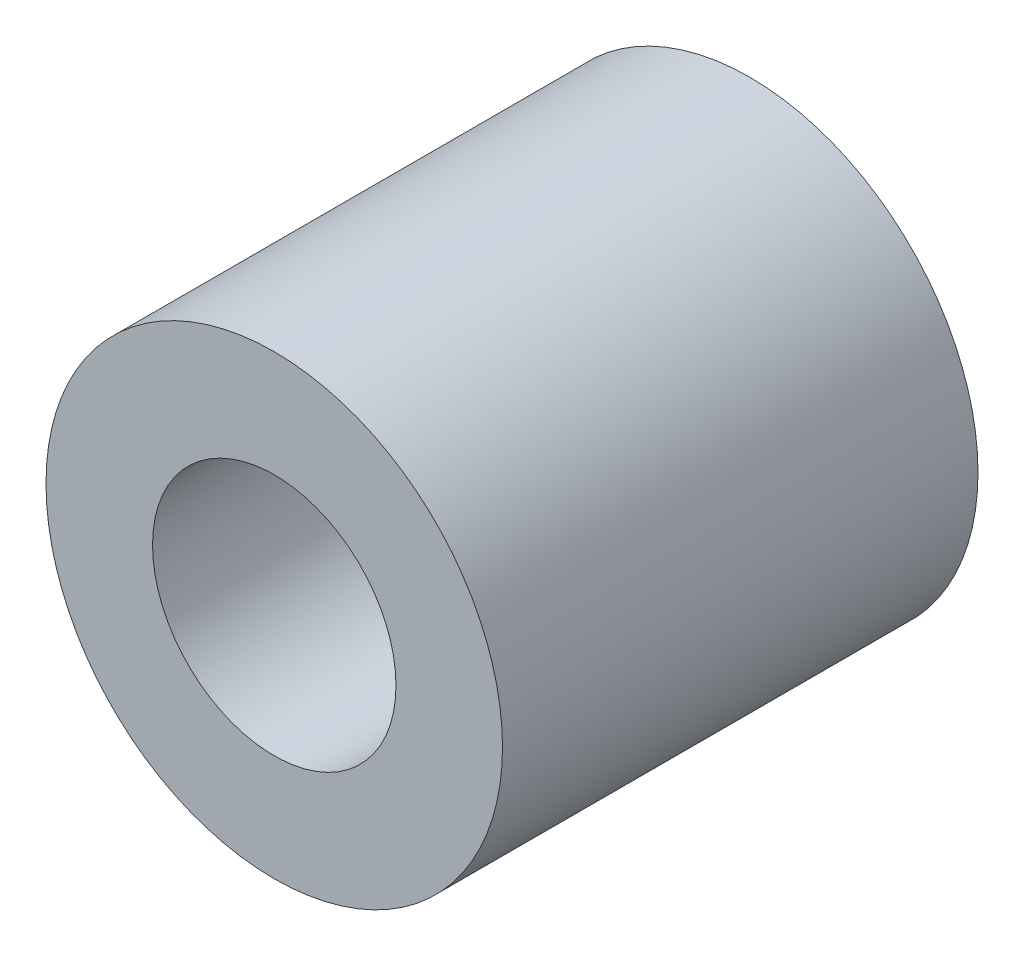
ISO-10303-21;
HEADER;
FILE_DESCRIPTION(('STEP AP214'),'2;1');
FILE_NAME('part.step','',(''),(''),'','','');
FILE_SCHEMA(('AUTOMOTIVE_DESIGN { 1 0 10303 214 1 1 1 1 }'));
ENDSEC;
DATA;
#1=APPLICATION_CONTEXT('core data for automotive mechanical design processes');
#2=APPLICATION_PROTOCOL_DEFINITION('international standard','automotive_design',2000,#1);
#3=PRODUCT_CONTEXT('',#1,'mechanical');
#4=PRODUCT('Part','Part','',(#3));
#5=PRODUCT_RELATED_PRODUCT_CATEGORY('part','',(#4));
#6=PRODUCT_DEFINITION_FORMATION('','',#4);
#7=PRODUCT_DEFINITION_CONTEXT('part definition',#1,'design');
#8=PRODUCT_DEFINITION('design','',#6,#7);
#9=PRODUCT_DEFINITION_SHAPE('','',#8);
#10=(LENGTH_UNIT() NAMED_UNIT(*) SI_UNIT(.MILLI.,.METRE.));
#11=(NAMED_UNIT(*) PLANE_ANGLE_UNIT() SI_UNIT($,.RADIAN.));
#12=(NAMED_UNIT(*) SI_UNIT($,.STERADIAN.) SOLID_ANGLE_UNIT());
#13=UNCERTAINTY_MEASURE_WITH_UNIT(LENGTH_MEASURE(1.E-05),#10,'distance_accuracy_value','');
#14=(GEOMETRIC_REPRESENTATION_CONTEXT(3) GLOBAL_UNCERTAINTY_ASSIGNED_CONTEXT((#13)) GLOBAL_UNIT_ASSIGNED_CONTEXT((#10,
#11,#12)) REPRESENTATION_CONTEXT('',''));
#15=CARTESIAN_POINT('',(0.,0.,0.));
#16=DIRECTION('',(0.,0.,1.));
#17=DIRECTION('',(1.,0.,0.));
#18=AXIS2_PLACEMENT_3D('',#15,#16,#17);
#19=CARTESIAN_POINT('',(0.,0.,6.25));
#20=DIRECTION('',(0.,0.,1.));
#21=DIRECTION('',(1.,0.,0.));
#22=AXIS2_PLACEMENT_3D('',#19,#20,#21);
#23=PLANE('',#22);
#24=CARTESIAN_POINT('',(0.,0.,6.25));
#25=DIRECTION('',(0.,0.,1.));
#26=DIRECTION('',(1.,0.,0.));
#27=AXIS2_PLACEMENT_3D('',#24,#25,#26);
#28=CIRCLE('',#27,3.);
#29=CARTESIAN_POINT('',(3.,0.,6.25));
#30=VERTEX_POINT('',#29);
#31=EDGE_CURVE('E10',#30,#30,#28,.T.);
#32=ORIENTED_EDGE('',*,*,#31,.T.);
#33=EDGE_LOOP('',(#32));
#34=FACE_BOUND('',#33,.T.);
#35=CARTESIAN_POINT('',(0.,0.,6.25));
#36=DIRECTION('',(0.,0.,1.));
#37=DIRECTION('',(1.,0.,0.));
#38=AXIS2_PLACEMENT_3D('',#35,#36,#37);
#39=CIRCLE('',#38,1.6);
#40=CARTESIAN_POINT('',(1.6,0.,6.25));
#41=VERTEX_POINT('',#40);
#42=EDGE_CURVE('E50',#41,#41,#39,.T.);
#43=ORIENTED_EDGE('',*,*,#42,.F.);
#44=EDGE_LOOP('',(#43));
#45=FACE_BOUND('',#44,.T.);
#46=ADVANCED_FACE('F37',(#34,#45),#23,.T.);
#47=CARTESIAN_POINT('',(0.,0.,0.));
#48=DIRECTION('',(0.,0.,1.));
#49=DIRECTION('',(1.,0.,0.));
#50=AXIS2_PLACEMENT_3D('',#47,#48,#49);
#51=PLANE('',#50);
#52=CARTESIAN_POINT('',(0.,0.,0.));
#53=DIRECTION('',(0.,0.,1.));
#54=DIRECTION('',(1.,0.,0.));
#55=AXIS2_PLACEMENT_3D('',#52,#53,#54);
#56=CIRCLE('',#55,3.);
#57=CARTESIAN_POINT('',(3.,0.,0.));
#58=VERTEX_POINT('',#57);
#59=EDGE_CURVE('E41',#58,#58,#56,.T.);
#60=ORIENTED_EDGE('',*,*,#59,.F.);
#61=EDGE_LOOP('',(#60));
#62=FACE_BOUND('',#61,.T.);
#63=CARTESIAN_POINT('',(0.,0.,0.));
#64=DIRECTION('',(0.,0.,1.));
#65=DIRECTION('',(1.,0.,0.));
#66=AXIS2_PLACEMENT_3D('',#63,#64,#65);
#67=CIRCLE('',#66,1.6);
#68=CARTESIAN_POINT('',(1.6,0.,0.));
#69=VERTEX_POINT('',#68);
#70=EDGE_CURVE('E52',#69,#69,#67,.T.);
#71=ORIENTED_EDGE('',*,*,#70,.T.);
#72=EDGE_LOOP('',(#71));
#73=FACE_BOUND('',#72,.T.);
#74=ADVANCED_FACE('F64',(#62,#73),#51,.F.);
#75=CARTESIAN_POINT('',(0.,0.,6.25));
#76=DIRECTION('',(0.,0.,-1.));
#77=DIRECTION('',(-1.,0.,0.));
#78=AXIS2_PLACEMENT_3D('',#75,#76,#77);
#79=CYLINDRICAL_SURFACE('',#78,3.);
#80=ORIENTED_EDGE('',*,*,#31,.F.);
#81=EDGE_LOOP('',(#80));
#82=FACE_BOUND('',#81,.T.);
#83=ORIENTED_EDGE('',*,*,#59,.T.);
#84=EDGE_LOOP('',(#83));
#85=FACE_BOUND('',#84,.T.);
#86=ADVANCED_FACE('F39',(#82,#85),#79,.T.);
#87=CARTESIAN_POINT('',(0.,0.,6.25));
#88=DIRECTION('',(0.,0.,-1.));
#89=DIRECTION('',(-1.,0.,0.));
#90=AXIS2_PLACEMENT_3D('',#87,#88,#89);
#91=CYLINDRICAL_SURFACE('',#90,1.6);
#92=ORIENTED_EDGE('',*,*,#42,.T.);
#93=EDGE_LOOP('',(#92));
#94=FACE_BOUND('',#93,.T.);
#95=ORIENTED_EDGE('',*,*,#70,.F.);
#96=EDGE_LOOP('',(#95));
#97=FACE_BOUND('',#96,.T.);
#98=ADVANCED_FACE('F60',(#94,#97),#91,.F.);
#99=CLOSED_SHELL('',(#46,#74,#86,#98));
#100=MANIFOLD_SOLID_BREP('B2',#99);
#101=ADVANCED_BREP_SHAPE_REPRESENTATION('',(#18,#100),#14);
#102=SHAPE_DEFINITION_REPRESENTATION(#9,#101);
ENDSEC;
END-ISO-10303-21;
